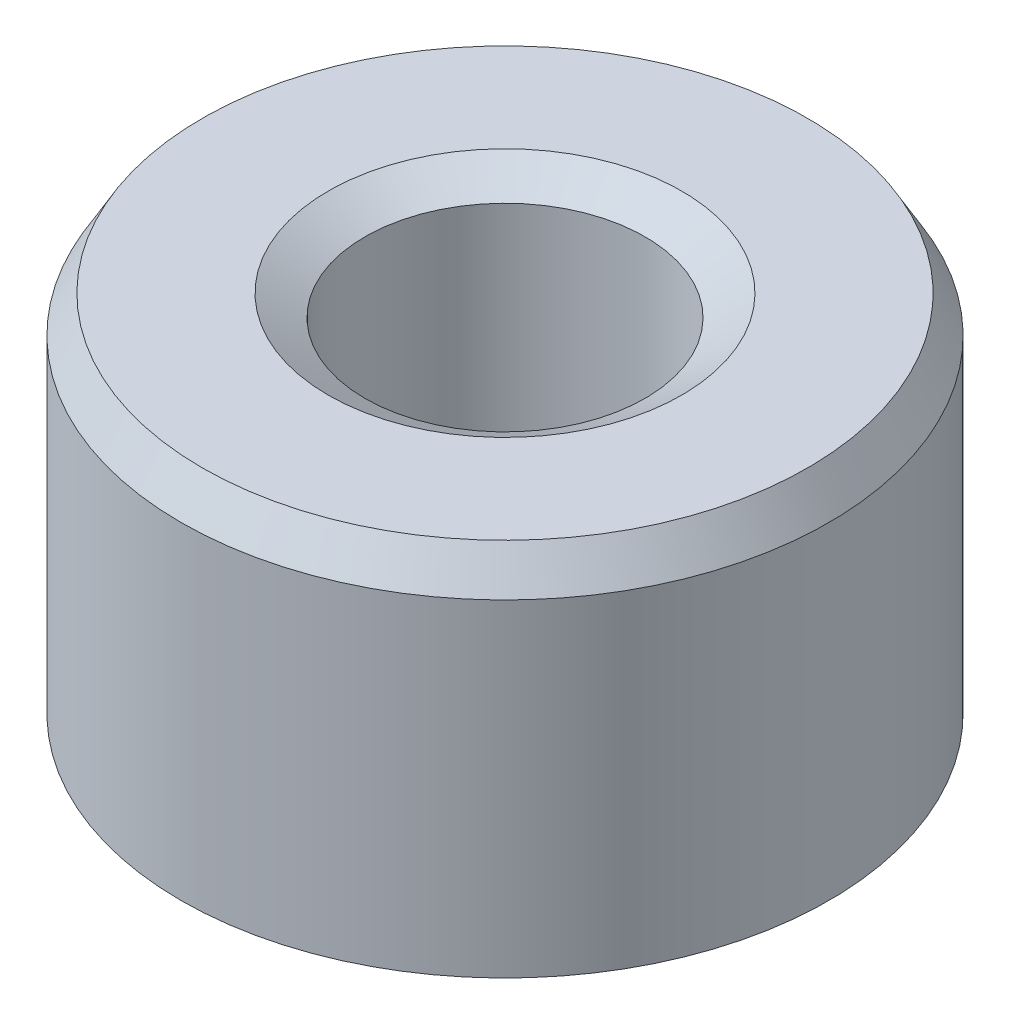
ISO-10303-21;
HEADER;
FILE_DESCRIPTION(('STEP AP214'),'2;1');
FILE_NAME('part.step','',(''),(''),'','','');
FILE_SCHEMA(('AUTOMOTIVE_DESIGN { 1 0 10303 214 1 1 1 1 }'));
ENDSEC;
DATA;
#1=APPLICATION_CONTEXT('core data for automotive mechanical design processes');
#2=APPLICATION_PROTOCOL_DEFINITION('international standard','automotive_design',2000,#1);
#3=PRODUCT_CONTEXT('',#1,'mechanical');
#4=PRODUCT('Part','Part','',(#3));
#5=PRODUCT_RELATED_PRODUCT_CATEGORY('part','',(#4));
#6=PRODUCT_DEFINITION_FORMATION('','',#4);
#7=PRODUCT_DEFINITION_CONTEXT('part definition',#1,'design');
#8=PRODUCT_DEFINITION('design','',#6,#7);
#9=PRODUCT_DEFINITION_SHAPE('','',#8);
#10=(LENGTH_UNIT() NAMED_UNIT(*) SI_UNIT(.MILLI.,.METRE.));
#11=(NAMED_UNIT(*) PLANE_ANGLE_UNIT() SI_UNIT($,.RADIAN.));
#12=(NAMED_UNIT(*) SI_UNIT($,.STERADIAN.) SOLID_ANGLE_UNIT());
#13=UNCERTAINTY_MEASURE_WITH_UNIT(LENGTH_MEASURE(1.E-05),#10,'distance_accuracy_value','');
#14=(GEOMETRIC_REPRESENTATION_CONTEXT(3) GLOBAL_UNCERTAINTY_ASSIGNED_CONTEXT((#13)) GLOBAL_UNIT_ASSIGNED_CONTEXT((#10,
#11,#12)) REPRESENTATION_CONTEXT('',''));
#15=CARTESIAN_POINT('',(0.,0.,0.));
#16=DIRECTION('',(0.,0.,1.));
#17=DIRECTION('',(1.,0.,0.));
#18=AXIS2_PLACEMENT_3D('',#15,#16,#17);
#19=CARTESIAN_POINT('',(0.,20.8153440117562,0.));
#20=DIRECTION('',(0.,-1.,0.));
#21=DIRECTION('',(0.,0.,-1.));
#22=AXIS2_PLACEMENT_3D('',#19,#20,#21);
#23=CYLINDRICAL_SURFACE('',#22,17.5);
#24=CARTESIAN_POINT('',(0.,1.14532919504449,0.));
#25=DIRECTION('',(0.,1.,0.));
#26=DIRECTION('',(0.,0.,1.));
#27=AXIS2_PLACEMENT_3D('',#24,#25,#26);
#28=CIRCLE('',#27,17.5);
#29=CARTESIAN_POINT('',(0.,1.14532919504449,17.5));
#30=VERTEX_POINT('',#29);
#31=EDGE_CURVE('E10',#30,#30,#28,.T.);
#32=ORIENTED_EDGE('',*,*,#31,.T.);
#33=EDGE_LOOP('',(#32));
#34=FACE_BOUND('',#33,.T.);
#35=CARTESIAN_POINT('',(0.,18.8315756545471,0.));
#36=DIRECTION('',(0.,1.,0.));
#37=DIRECTION('',(0.,0.,1.));
#38=AXIS2_PLACEMENT_3D('',#35,#36,#37);
#39=CIRCLE('',#38,17.5);
#40=CARTESIAN_POINT('',(0.,18.8315756545471,17.5));
#41=VERTEX_POINT('',#40);
#42=EDGE_CURVE('E50',#41,#41,#39,.F.);
#43=ORIENTED_EDGE('',*,*,#42,.T.);
#44=EDGE_LOOP('',(#43));
#45=FACE_BOUND('',#44,.T.);
#46=ADVANCED_FACE('F39',(#34,#45),#23,.T.);
#47=CARTESIAN_POINT('',(0.,20.8153440117562,0.));
#48=DIRECTION('',(0.,1.,0.));
#49=DIRECTION('',(0.,0.,1.));
#50=AXIS2_PLACEMENT_3D('',#47,#48,#49);
#51=PLANE('',#50);
#52=CARTESIAN_POINT('',(0.,20.8153440117562,0.));
#53=DIRECTION('',(0.,1.,0.));
#54=DIRECTION('',(0.,0.,1.));
#55=AXIS2_PLACEMENT_3D('',#52,#53,#54);
#56=CIRCLE('',#55,9.5498800557493);
#57=CARTESIAN_POINT('',(0.,20.8153440117562,9.5498800557493));
#58=VERTEX_POINT('',#57);
#59=EDGE_CURVE('E58',#58,#58,#56,.F.);
#60=ORIENTED_EDGE('',*,*,#59,.T.);
#61=EDGE_LOOP('',(#60));
#62=FACE_BOUND('',#61,.T.);
#63=CARTESIAN_POINT('',(0.,20.8153440117562,0.));
#64=DIRECTION('',(0.,1.,0.));
#65=DIRECTION('',(0.,0.,1.));
#66=AXIS2_PLACEMENT_3D('',#63,#64,#65);
#67=CIRCLE('',#66,16.3546708049555);
#68=CARTESIAN_POINT('',(0.,20.8153440117562,16.3546708049555));
#69=VERTEX_POINT('',#68);
#70=EDGE_CURVE('E61',#69,#69,#67,.T.);
#71=ORIENTED_EDGE('',*,*,#70,.T.);
#72=EDGE_LOOP('',(#71));
#73=FACE_BOUND('',#72,.T.);
#74=ADVANCED_FACE('F88',(#62,#73),#51,.T.);
#75=CARTESIAN_POINT('',(0.,0.,0.));
#76=DIRECTION('',(0.,1.,0.));
#77=DIRECTION('',(0.,0.,1.));
#78=AXIS2_PLACEMENT_3D('',#75,#76,#77);
#79=PLANE('',#78);
#80=CARTESIAN_POINT('',(0.,0.,0.));
#81=DIRECTION('',(0.,1.,0.));
#82=DIRECTION('',(0.,0.,1.));
#83=AXIS2_PLACEMENT_3D('',#80,#81,#82);
#84=CIRCLE('',#83,8.71144089358476);
#85=CARTESIAN_POINT('',(0.,0.,8.71144089358476));
#86=VERTEX_POINT('',#85);
#87=EDGE_CURVE('E51',#86,#86,#84,.T.);
#88=ORIENTED_EDGE('',*,*,#87,.T.);
#89=EDGE_LOOP('',(#88));
#90=FACE_BOUND('',#89,.T.);
#91=CARTESIAN_POINT('',(0.,0.,0.));
#92=DIRECTION('',(0.,1.,0.));
#93=DIRECTION('',(0.,0.,1.));
#94=AXIS2_PLACEMENT_3D('',#91,#92,#93);
#95=CIRCLE('',#94,15.516231642791);
#96=CARTESIAN_POINT('',(0.,0.,15.516231642791));
#97=VERTEX_POINT('',#96);
#98=EDGE_CURVE('E54',#97,#97,#95,.F.);
#99=ORIENTED_EDGE('',*,*,#98,.T.);
#100=EDGE_LOOP('',(#99));
#101=FACE_BOUND('',#100,.T.);
#102=ADVANCED_FACE('F83',(#90,#101),#79,.F.);
#103=CARTESIAN_POINT('',(0.,20.8153440117562,0.));
#104=DIRECTION('',(0.,-1.,0.));
#105=DIRECTION('',(0.,0.,-1.));
#106=AXIS2_PLACEMENT_3D('',#103,#104,#105);
#107=CYLINDRICAL_SURFACE('',#106,7.56611169854025);
#108=CARTESIAN_POINT('',(0.,19.6700148167117,0.));
#109=DIRECTION('',(0.,1.,0.));
#110=DIRECTION('',(0.,0.,1.));
#111=AXIS2_PLACEMENT_3D('',#108,#109,#110);
#112=CIRCLE('',#111,7.56611169854025);
#113=CARTESIAN_POINT('',(0.,19.6700148167117,7.56611169854025));
#114=VERTEX_POINT('',#113);
#115=EDGE_CURVE('E67',#114,#114,#112,.T.);
#116=ORIENTED_EDGE('',*,*,#115,.T.);
#117=EDGE_LOOP('',(#116));
#118=FACE_BOUND('',#117,.T.);
#119=CARTESIAN_POINT('',(0.,1.98376835720905,0.));
#120=DIRECTION('',(0.,1.,0.));
#121=DIRECTION('',(0.,0.,1.));
#122=AXIS2_PLACEMENT_3D('',#119,#120,#121);
#123=CIRCLE('',#122,7.56611169854025);
#124=CARTESIAN_POINT('',(0.,1.98376835720905,7.56611169854025));
#125=VERTEX_POINT('',#124);
#126=EDGE_CURVE('E69',#125,#125,#123,.F.);
#127=ORIENTED_EDGE('',*,*,#126,.T.);
#128=EDGE_LOOP('',(#127));
#129=FACE_BOUND('',#128,.T.);
#130=ADVANCED_FACE('F71',(#118,#129),#107,.F.);
#131=CARTESIAN_POINT('',(0.,19.6700148167117,0.));
#132=DIRECTION('',(0.,1.,0.));
#133=DIRECTION('',(0.,0.,1.));
#134=AXIS2_PLACEMENT_3D('',#131,#132,#133);
#135=CONICAL_SURFACE('',#134,7.56611169854025,1.0471975511966);
#136=ORIENTED_EDGE('',*,*,#59,.F.);
#137=EDGE_LOOP('',(#136));
#138=FACE_BOUND('',#137,.T.);
#139=ORIENTED_EDGE('',*,*,#115,.F.);
#140=EDGE_LOOP('',(#139));
#141=FACE_BOUND('',#140,.T.);
#142=ADVANCED_FACE('F77',(#138,#141),#135,.F.);
#143=CARTESIAN_POINT('',(0.,0.,0.));
#144=DIRECTION('',(0.,-1.,0.));
#145=DIRECTION('',(0.,0.,-1.));
#146=AXIS2_PLACEMENT_3D('',#143,#144,#145);
#147=CONICAL_SURFACE('',#146,8.71144089358476,0.523598775598296);
#148=ORIENTED_EDGE('',*,*,#126,.F.);
#149=EDGE_LOOP('',(#148));
#150=FACE_BOUND('',#149,.T.);
#151=ORIENTED_EDGE('',*,*,#87,.F.);
#152=EDGE_LOOP('',(#151));
#153=FACE_BOUND('',#152,.T.);
#154=ADVANCED_FACE('F73',(#150,#153),#147,.F.);
#155=CARTESIAN_POINT('',(0.,1.14532919504449,0.));
#156=DIRECTION('',(0.,1.,0.));
#157=DIRECTION('',(0.,0.,1.));
#158=AXIS2_PLACEMENT_3D('',#155,#156,#157);
#159=CONICAL_SURFACE('',#158,17.5,1.0471975511966);
#160=ORIENTED_EDGE('',*,*,#98,.F.);
#161=EDGE_LOOP('',(#160));
#162=FACE_BOUND('',#161,.T.);
#163=ORIENTED_EDGE('',*,*,#31,.F.);
#164=EDGE_LOOP('',(#163));
#165=FACE_BOUND('',#164,.T.);
#166=ADVANCED_FACE('F76',(#162,#165),#159,.T.);
#167=CARTESIAN_POINT('',(0.,20.8153440117562,0.));
#168=DIRECTION('',(0.,-1.,0.));
#169=DIRECTION('',(0.,0.,-1.));
#170=AXIS2_PLACEMENT_3D('',#167,#168,#169);
#171=CONICAL_SURFACE('',#170,16.3546708049555,0.523598775598295);
#172=ORIENTED_EDGE('',*,*,#42,.F.);
#173=EDGE_LOOP('',(#172));
#174=FACE_BOUND('',#173,.T.);
#175=ORIENTED_EDGE('',*,*,#70,.F.);
#176=EDGE_LOOP('',(#175));
#177=FACE_BOUND('',#176,.T.);
#178=ADVANCED_FACE('F45',(#174,#177),#171,.T.);
#179=CLOSED_SHELL('',(#46,#74,#102,#130,#142,#154,#166,#178));
#180=MANIFOLD_SOLID_BREP('B2',#179);
#181=ADVANCED_BREP_SHAPE_REPRESENTATION('',(#18,#180),#14);
#182=SHAPE_DEFINITION_REPRESENTATION(#9,#181);
ENDSEC;
END-ISO-10303-21;
